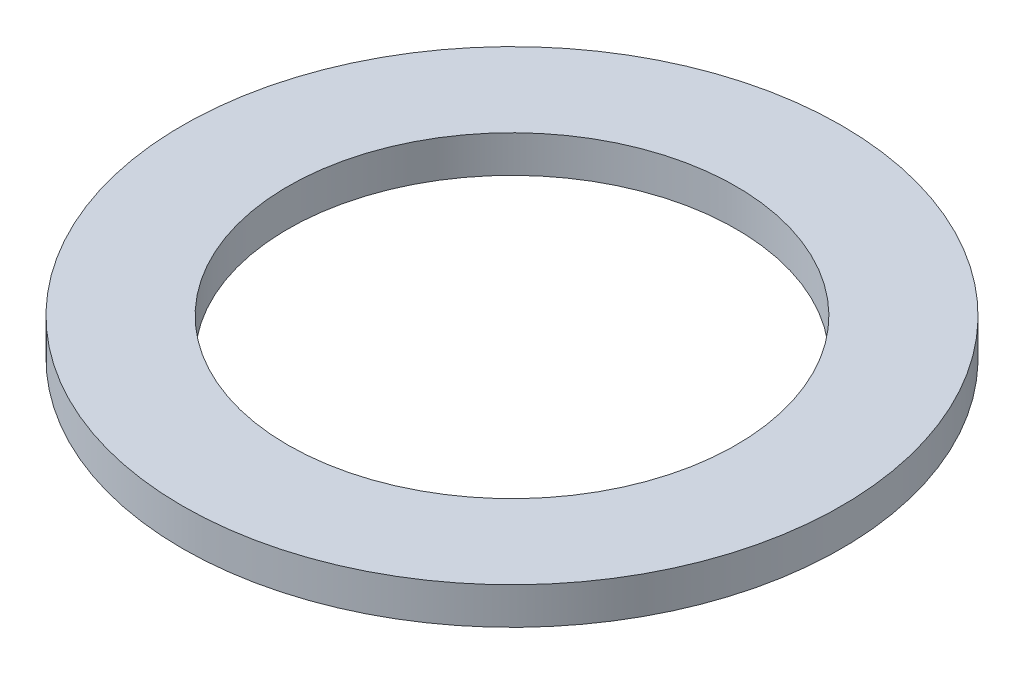
ISO-10303-21;
HEADER;
FILE_DESCRIPTION(('STEP AP214'),'2;1');
FILE_NAME('part.step','',(''),(''),'','','');
FILE_SCHEMA(('AUTOMOTIVE_DESIGN { 1 0 10303 214 1 1 1 1 }'));
ENDSEC;
DATA;
#1=APPLICATION_CONTEXT('core data for automotive mechanical design processes');
#2=APPLICATION_PROTOCOL_DEFINITION('international standard','automotive_design',2000,#1);
#3=PRODUCT_CONTEXT('',#1,'mechanical');
#4=PRODUCT('Part','Part','',(#3));
#5=PRODUCT_RELATED_PRODUCT_CATEGORY('part','',(#4));
#6=PRODUCT_DEFINITION_FORMATION('','',#4);
#7=PRODUCT_DEFINITION_CONTEXT('part definition',#1,'design');
#8=PRODUCT_DEFINITION('design','',#6,#7);
#9=PRODUCT_DEFINITION_SHAPE('','',#8);
#10=(LENGTH_UNIT() NAMED_UNIT(*) SI_UNIT(.MILLI.,.METRE.));
#11=(NAMED_UNIT(*) PLANE_ANGLE_UNIT() SI_UNIT($,.RADIAN.));
#12=(NAMED_UNIT(*) SI_UNIT($,.STERADIAN.) SOLID_ANGLE_UNIT());
#13=UNCERTAINTY_MEASURE_WITH_UNIT(LENGTH_MEASURE(1.E-05),#10,'distance_accuracy_value','');
#14=(GEOMETRIC_REPRESENTATION_CONTEXT(3) GLOBAL_UNCERTAINTY_ASSIGNED_CONTEXT((#13)) GLOBAL_UNIT_ASSIGNED_CONTEXT((#10,
#11,#12)) REPRESENTATION_CONTEXT('',''));
#15=CARTESIAN_POINT('',(0.,0.,0.));
#16=DIRECTION('',(0.,0.,1.));
#17=DIRECTION('',(1.,0.,0.));
#18=AXIS2_PLACEMENT_3D('',#15,#16,#17);
#19=CARTESIAN_POINT('',(0.,7.,0.));
#20=DIRECTION('',(0.,-1.,0.));
#21=DIRECTION('',(0.,0.,-1.));
#22=AXIS2_PLACEMENT_3D('',#19,#20,#21);
#23=CYLINDRICAL_SURFACE('',#22,62.5);
#24=CARTESIAN_POINT('',(0.,7.,0.));
#25=DIRECTION('',(0.,1.,0.));
#26=DIRECTION('',(0.,0.,1.));
#27=AXIS2_PLACEMENT_3D('',#24,#25,#26);
#28=CIRCLE('',#27,62.5);
#29=CARTESIAN_POINT('',(0.,7.,62.5));
#30=VERTEX_POINT('',#29);
#31=EDGE_CURVE('E10',#30,#30,#28,.T.);
#32=ORIENTED_EDGE('',*,*,#31,.F.);
#33=EDGE_LOOP('',(#32));
#34=FACE_BOUND('',#33,.T.);
#35=CARTESIAN_POINT('',(0.,0.,0.));
#36=DIRECTION('',(0.,1.,0.));
#37=DIRECTION('',(0.,0.,1.));
#38=AXIS2_PLACEMENT_3D('',#35,#36,#37);
#39=CIRCLE('',#38,62.5);
#40=CARTESIAN_POINT('',(0.,0.,62.5));
#41=VERTEX_POINT('',#40);
#42=EDGE_CURVE('E37',#41,#41,#39,.T.);
#43=ORIENTED_EDGE('',*,*,#42,.T.);
#44=EDGE_LOOP('',(#43));
#45=FACE_BOUND('',#44,.T.);
#46=ADVANCED_FACE('F40',(#34,#45),#23,.T.);
#47=CARTESIAN_POINT('',(0.,7.,0.));
#48=DIRECTION('',(0.,1.,0.));
#49=DIRECTION('',(0.,0.,1.));
#50=AXIS2_PLACEMENT_3D('',#47,#48,#49);
#51=PLANE('',#50);
#52=CARTESIAN_POINT('',(0.,7.,0.));
#53=DIRECTION('',(0.,1.,0.));
#54=DIRECTION('',(0.,0.,1.));
#55=AXIS2_PLACEMENT_3D('',#52,#53,#54);
#56=CIRCLE('',#55,42.5);
#57=CARTESIAN_POINT('',(0.,7.,42.5));
#58=VERTEX_POINT('',#57);
#59=EDGE_CURVE('E50',#58,#58,#56,.T.);
#60=ORIENTED_EDGE('',*,*,#59,.F.);
#61=EDGE_LOOP('',(#60));
#62=FACE_BOUND('',#61,.T.);
#63=ORIENTED_EDGE('',*,*,#31,.T.);
#64=EDGE_LOOP('',(#63));
#65=FACE_BOUND('',#64,.T.);
#66=ADVANCED_FACE('F59',(#62,#65),#51,.T.);
#67=CARTESIAN_POINT('',(0.,0.,0.));
#68=DIRECTION('',(0.,1.,0.));
#69=DIRECTION('',(0.,0.,1.));
#70=AXIS2_PLACEMENT_3D('',#67,#68,#69);
#71=PLANE('',#70);
#72=CARTESIAN_POINT('',(0.,0.,0.));
#73=DIRECTION('',(0.,1.,0.));
#74=DIRECTION('',(0.,0.,1.));
#75=AXIS2_PLACEMENT_3D('',#72,#73,#74);
#76=CIRCLE('',#75,42.5);
#77=CARTESIAN_POINT('',(0.,0.,42.5));
#78=VERTEX_POINT('',#77);
#79=EDGE_CURVE('E47',#78,#78,#76,.T.);
#80=ORIENTED_EDGE('',*,*,#79,.T.);
#81=EDGE_LOOP('',(#80));
#82=FACE_BOUND('',#81,.T.);
#83=ORIENTED_EDGE('',*,*,#42,.F.);
#84=EDGE_LOOP('',(#83));
#85=FACE_BOUND('',#84,.T.);
#86=ADVANCED_FACE('F58',(#82,#85),#71,.F.);
#87=CARTESIAN_POINT('',(0.,7.,0.));
#88=DIRECTION('',(0.,-1.,0.));
#89=DIRECTION('',(0.,0.,-1.));
#90=AXIS2_PLACEMENT_3D('',#87,#88,#89);
#91=CYLINDRICAL_SURFACE('',#90,42.5);
#92=ORIENTED_EDGE('',*,*,#59,.T.);
#93=EDGE_LOOP('',(#92));
#94=FACE_BOUND('',#93,.T.);
#95=ORIENTED_EDGE('',*,*,#79,.F.);
#96=EDGE_LOOP('',(#95));
#97=FACE_BOUND('',#96,.T.);
#98=ADVANCED_FACE('F54',(#94,#97),#91,.F.);
#99=CLOSED_SHELL('',(#46,#66,#86,#98));
#100=MANIFOLD_SOLID_BREP('B2',#99);
#101=ADVANCED_BREP_SHAPE_REPRESENTATION('',(#18,#100),#14);
#102=SHAPE_DEFINITION_REPRESENTATION(#9,#101);
ENDSEC;
END-ISO-10303-21;
